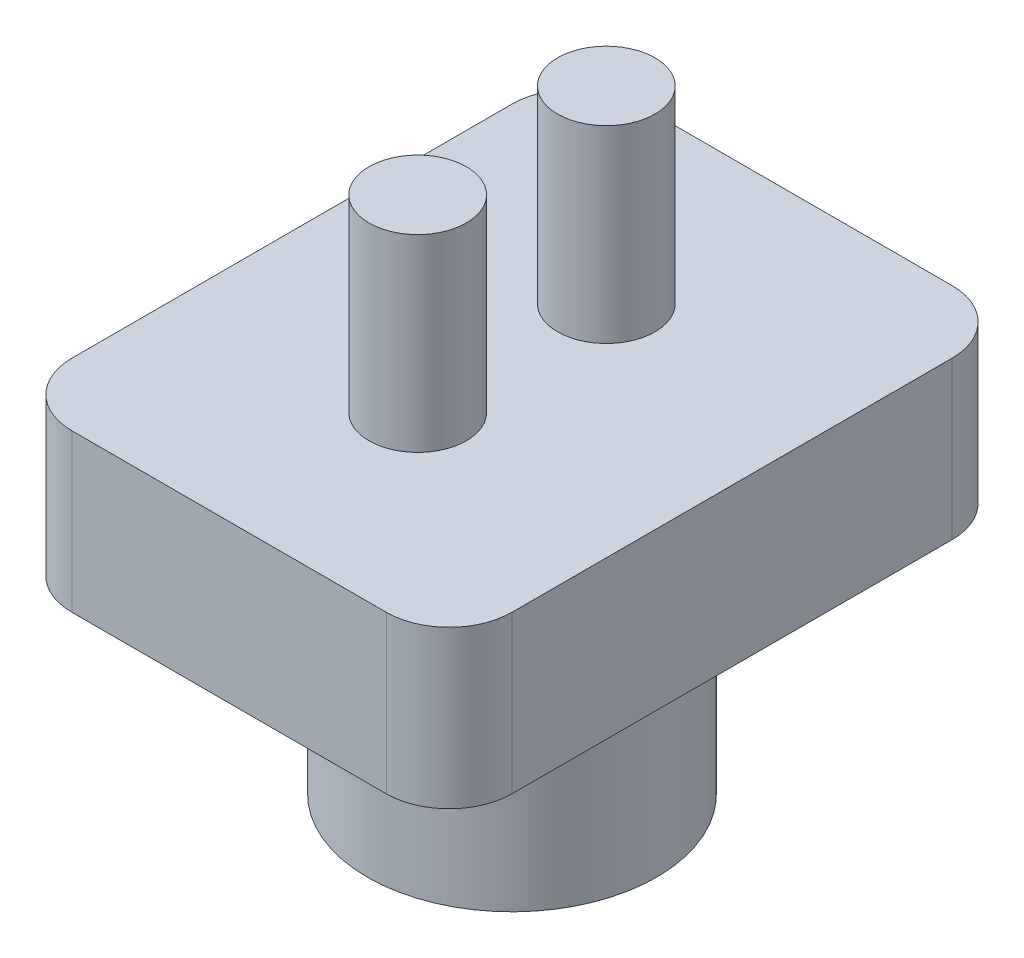
ISO-10303-21;
HEADER;
FILE_DESCRIPTION(('STEP AP214'),'2;1');
FILE_NAME('part.step','',(''),(''),'','','');
FILE_SCHEMA(('AUTOMOTIVE_DESIGN { 1 0 10303 214 1 1 1 1 }'));
ENDSEC;
DATA;
#1=APPLICATION_CONTEXT('core data for automotive mechanical design processes');
#2=APPLICATION_PROTOCOL_DEFINITION('international standard','automotive_design',2000,#1);
#3=PRODUCT_CONTEXT('',#1,'mechanical');
#4=PRODUCT('Part','Part','',(#3));
#5=PRODUCT_RELATED_PRODUCT_CATEGORY('part','',(#4));
#6=PRODUCT_DEFINITION_FORMATION('','',#4);
#7=PRODUCT_DEFINITION_CONTEXT('part definition',#1,'design');
#8=PRODUCT_DEFINITION('design','',#6,#7);
#9=PRODUCT_DEFINITION_SHAPE('','',#8);
#10=(LENGTH_UNIT() NAMED_UNIT(*) SI_UNIT(.MILLI.,.METRE.));
#11=(NAMED_UNIT(*) PLANE_ANGLE_UNIT() SI_UNIT($,.RADIAN.));
#12=(NAMED_UNIT(*) SI_UNIT($,.STERADIAN.) SOLID_ANGLE_UNIT());
#13=UNCERTAINTY_MEASURE_WITH_UNIT(LENGTH_MEASURE(1.E-05),#10,'distance_accuracy_value','');
#14=(GEOMETRIC_REPRESENTATION_CONTEXT(3) GLOBAL_UNCERTAINTY_ASSIGNED_CONTEXT((#13)) GLOBAL_UNIT_ASSIGNED_CONTEXT((#10,
#11,#12)) REPRESENTATION_CONTEXT('',''));
#15=CARTESIAN_POINT('',(0.,0.,0.));
#16=DIRECTION('',(0.,0.,1.));
#17=DIRECTION('',(1.,0.,0.));
#18=AXIS2_PLACEMENT_3D('',#15,#16,#17);
#19=CARTESIAN_POINT('',(0.,7.,0.));
#20=DIRECTION('',(0.,-1.,0.));
#21=DIRECTION('',(0.,0.,-1.));
#22=AXIS2_PLACEMENT_3D('',#19,#20,#21);
#23=CYLINDRICAL_SURFACE('',#22,2.8);
#24=CARTESIAN_POINT('',(0.,7.,0.));
#25=DIRECTION('',(0.,1.,0.));
#26=DIRECTION('',(0.,0.,1.));
#27=AXIS2_PLACEMENT_3D('',#24,#25,#26);
#28=CIRCLE('',#27,2.8);
#29=CARTESIAN_POINT('',(0.,7.,2.8));
#30=VERTEX_POINT('',#29);
#31=EDGE_CURVE('E143',#30,#30,#28,.T.);
#32=ORIENTED_EDGE('',*,*,#31,.T.);
#33=EDGE_LOOP('',(#32));
#34=FACE_BOUND('',#33,.T.);
#35=CARTESIAN_POINT('',(0.,0.,0.));
#36=DIRECTION('',(0.,1.,0.));
#37=DIRECTION('',(0.,0.,1.));
#38=AXIS2_PLACEMENT_3D('',#35,#36,#37);
#39=CIRCLE('',#38,2.8);
#40=CARTESIAN_POINT('',(0.,0.,2.8));
#41=VERTEX_POINT('',#40);
#42=EDGE_CURVE('E146',#41,#41,#39,.T.);
#43=ORIENTED_EDGE('',*,*,#42,.F.);
#44=EDGE_LOOP('',(#43));
#45=FACE_BOUND('',#44,.T.);
#46=ADVANCED_FACE('F34',(#34,#45),#23,.F.);
#47=CARTESIAN_POINT('',(0.,7.,0.));
#48=DIRECTION('',(0.,-1.,0.));
#49=DIRECTION('',(0.,0.,-1.));
#50=AXIS2_PLACEMENT_3D('',#47,#48,#49);
#51=CYLINDRICAL_SURFACE('',#50,4.6);
#52=CARTESIAN_POINT('',(0.,7.,0.));
#53=DIRECTION('',(0.,1.,0.));
#54=DIRECTION('',(0.,0.,1.));
#55=AXIS2_PLACEMENT_3D('',#52,#53,#54);
#56=CIRCLE('',#55,4.6);
#57=CARTESIAN_POINT('',(0.,7.,4.6));
#58=VERTEX_POINT('',#57);
#59=EDGE_CURVE('E147',#58,#58,#56,.T.);
#60=ORIENTED_EDGE('',*,*,#59,.F.);
#61=EDGE_LOOP('',(#60));
#62=FACE_BOUND('',#61,.T.);
#63=CARTESIAN_POINT('',(0.,0.,0.));
#64=DIRECTION('',(0.,1.,0.));
#65=DIRECTION('',(0.,0.,1.));
#66=AXIS2_PLACEMENT_3D('',#63,#64,#65);
#67=CIRCLE('',#66,4.6);
#68=CARTESIAN_POINT('',(0.,0.,4.6));
#69=VERTEX_POINT('',#68);
#70=EDGE_CURVE('E150',#69,#69,#67,.T.);
#71=ORIENTED_EDGE('',*,*,#70,.T.);
#72=EDGE_LOOP('',(#71));
#73=FACE_BOUND('',#72,.T.);
#74=ADVANCED_FACE('F229',(#62,#73),#51,.T.);
#75=CARTESIAN_POINT('',(0.,0.,0.));
#76=DIRECTION('',(0.,1.,0.));
#77=DIRECTION('',(0.,0.,1.));
#78=AXIS2_PLACEMENT_3D('',#75,#76,#77);
#79=PLANE('',#78);
#80=ORIENTED_EDGE('',*,*,#42,.T.);
#81=EDGE_LOOP('',(#80));
#82=FACE_BOUND('',#81,.T.);
#83=ORIENTED_EDGE('',*,*,#70,.F.);
#84=EDGE_LOOP('',(#83));
#85=FACE_BOUND('',#84,.T.);
#86=ADVANCED_FACE('F235',(#82,#85),#79,.F.);
#87=CARTESIAN_POINT('',(0.,7.,0.));
#88=DIRECTION('',(0.,1.,0.));
#89=DIRECTION('',(0.,0.,1.));
#90=AXIS2_PLACEMENT_3D('',#87,#88,#89);
#91=PLANE('',#90);
#92=ORIENTED_EDGE('',*,*,#59,.T.);
#93=EDGE_LOOP('',(#92));
#94=FACE_BOUND('',#93,.T.);
#95=DIRECTION('',(1.,0.,0.));
#96=VECTOR('',#95,1.);
#97=CARTESIAN_POINT('',(0.,7.,9.));
#98=LINE('',#97,#96);
#99=CARTESIAN_POINT('',(-5.,7.,9.));
#100=VERTEX_POINT('',#99);
#101=CARTESIAN_POINT('',(5.,7.,9.));
#102=VERTEX_POINT('',#101);
#103=EDGE_CURVE('E117',#100,#102,#98,.T.);
#104=ORIENTED_EDGE('',*,*,#103,.F.);
#105=CARTESIAN_POINT('',(-5.,7.,7.));
#106=DIRECTION('',(0.,1.,0.));
#107=DIRECTION('',(0.,0.,1.));
#108=AXIS2_PLACEMENT_3D('',#105,#106,#107);
#109=CIRCLE('',#108,2.);
#110=CARTESIAN_POINT('',(-7.,7.,7.));
#111=VERTEX_POINT('',#110);
#112=EDGE_CURVE('E100',#100,#111,#109,.F.);
#113=ORIENTED_EDGE('',*,*,#112,.T.);
#114=DIRECTION('',(0.,0.,-1.));
#115=VECTOR('',#114,1.);
#116=CARTESIAN_POINT('',(-7.,7.,0.));
#117=LINE('',#116,#115);
#118=CARTESIAN_POINT('',(-7.,7.,-7.));
#119=VERTEX_POINT('',#118);
#120=EDGE_CURVE('E141',#111,#119,#117,.T.);
#121=ORIENTED_EDGE('',*,*,#120,.T.);
#122=CARTESIAN_POINT('',(-5.,7.,-7.));
#123=DIRECTION('',(0.,1.,0.));
#124=DIRECTION('',(0.,0.,1.));
#125=AXIS2_PLACEMENT_3D('',#122,#123,#124);
#126=CIRCLE('',#125,2.);
#127=CARTESIAN_POINT('',(-5.,7.,-9.));
#128=VERTEX_POINT('',#127);
#129=EDGE_CURVE('E111',#119,#128,#126,.F.);
#130=ORIENTED_EDGE('',*,*,#129,.T.);
#131=DIRECTION('',(1.,0.,0.));
#132=VECTOR('',#131,1.);
#133=CARTESIAN_POINT('',(0.,7.,-9.));
#134=LINE('',#133,#132);
#135=CARTESIAN_POINT('',(5.,7.,-9.));
#136=VERTEX_POINT('',#135);
#137=EDGE_CURVE('E130',#128,#136,#134,.T.);
#138=ORIENTED_EDGE('',*,*,#137,.T.);
#139=CARTESIAN_POINT('',(5.,7.,-7.));
#140=DIRECTION('',(0.,1.,0.));
#141=DIRECTION('',(0.,0.,1.));
#142=AXIS2_PLACEMENT_3D('',#139,#140,#141);
#143=CIRCLE('',#142,2.);
#144=CARTESIAN_POINT('',(7.,7.,-7.));
#145=VERTEX_POINT('',#144);
#146=EDGE_CURVE('E157',#136,#145,#143,.F.);
#147=ORIENTED_EDGE('',*,*,#146,.T.);
#148=DIRECTION('',(0.,0.,-1.));
#149=VECTOR('',#148,1.);
#150=CARTESIAN_POINT('',(7.,7.,0.));
#151=LINE('',#150,#149);
#152=CARTESIAN_POINT('',(7.,7.,7.));
#153=VERTEX_POINT('',#152);
#154=EDGE_CURVE('E126',#153,#145,#151,.T.);
#155=ORIENTED_EDGE('',*,*,#154,.F.);
#156=CARTESIAN_POINT('',(5.,7.,7.));
#157=DIRECTION('',(0.,1.,0.));
#158=DIRECTION('',(0.,0.,1.));
#159=AXIS2_PLACEMENT_3D('',#156,#157,#158);
#160=CIRCLE('',#159,2.);
#161=EDGE_CURVE('E121',#153,#102,#160,.F.);
#162=ORIENTED_EDGE('',*,*,#161,.T.);
#163=EDGE_LOOP('',(#104,#113,#121,#130,#138,#147,#155,#162));
#164=FACE_BOUND('',#163,.T.);
#165=ADVANCED_FACE('F124',(#94,#164),#91,.F.);
#166=CARTESIAN_POINT('',(0.,12.,0.));
#167=DIRECTION('',(0.,1.,0.));
#168=DIRECTION('',(0.,0.,1.));
#169=AXIS2_PLACEMENT_3D('',#166,#167,#168);
#170=PLANE('',#169);
#171=CARTESIAN_POINT('',(0.,12.,3.));
#172=DIRECTION('',(0.,1.,0.));
#173=DIRECTION('',(0.,0.,1.));
#174=AXIS2_PLACEMENT_3D('',#171,#172,#173);
#175=CIRCLE('',#174,1.55);
#176=CARTESIAN_POINT('',(0.,12.,4.55));
#177=VERTEX_POINT('',#176);
#178=EDGE_CURVE('E195',#177,#177,#175,.T.);
#179=ORIENTED_EDGE('',*,*,#178,.F.);
#180=EDGE_LOOP('',(#179));
#181=FACE_BOUND('',#180,.T.);
#182=CARTESIAN_POINT('',(0.,12.,-3.));
#183=DIRECTION('',(0.,1.,0.));
#184=DIRECTION('',(0.,0.,1.));
#185=AXIS2_PLACEMENT_3D('',#182,#183,#184);
#186=CIRCLE('',#185,1.55);
#187=CARTESIAN_POINT('',(0.,12.,-1.45));
#188=VERTEX_POINT('',#187);
#189=EDGE_CURVE('E133',#188,#188,#186,.T.);
#190=ORIENTED_EDGE('',*,*,#189,.F.);
#191=EDGE_LOOP('',(#190));
#192=FACE_BOUND('',#191,.T.);
#193=DIRECTION('',(0.,0.,-1.));
#194=VECTOR('',#193,1.);
#195=CARTESIAN_POINT('',(-7.,12.,0.));
#196=LINE('',#195,#194);
#197=CARTESIAN_POINT('',(-7.,12.,7.));
#198=VERTEX_POINT('',#197);
#199=CARTESIAN_POINT('',(-7.,12.,-7.));
#200=VERTEX_POINT('',#199);
#201=EDGE_CURVE('E136',#198,#200,#196,.T.);
#202=ORIENTED_EDGE('',*,*,#201,.F.);
#203=CARTESIAN_POINT('',(-5.,12.,7.));
#204=DIRECTION('',(0.,1.,0.));
#205=DIRECTION('',(0.,0.,1.));
#206=AXIS2_PLACEMENT_3D('',#203,#204,#205);
#207=CIRCLE('',#206,2.);
#208=CARTESIAN_POINT('',(-5.,12.,9.));
#209=VERTEX_POINT('',#208);
#210=EDGE_CURVE('E168',#198,#209,#207,.T.);
#211=ORIENTED_EDGE('',*,*,#210,.T.);
#212=DIRECTION('',(1.,0.,0.));
#213=VECTOR('',#212,1.);
#214=CARTESIAN_POINT('',(0.,12.,9.));
#215=LINE('',#214,#213);
#216=CARTESIAN_POINT('',(5.,12.,9.));
#217=VERTEX_POINT('',#216);
#218=EDGE_CURVE('E120',#209,#217,#215,.T.);
#219=ORIENTED_EDGE('',*,*,#218,.T.);
#220=CARTESIAN_POINT('',(5.,12.,7.));
#221=DIRECTION('',(0.,1.,0.));
#222=DIRECTION('',(0.,0.,1.));
#223=AXIS2_PLACEMENT_3D('',#220,#221,#222);
#224=CIRCLE('',#223,2.);
#225=CARTESIAN_POINT('',(7.,12.,7.));
#226=VERTEX_POINT('',#225);
#227=EDGE_CURVE('E163',#217,#226,#224,.T.);
#228=ORIENTED_EDGE('',*,*,#227,.T.);
#229=DIRECTION('',(0.,0.,-1.));
#230=VECTOR('',#229,1.);
#231=CARTESIAN_POINT('',(7.,12.,0.));
#232=LINE('',#231,#230);
#233=CARTESIAN_POINT('',(7.,12.,-7.));
#234=VERTEX_POINT('',#233);
#235=EDGE_CURVE('E179',#226,#234,#232,.T.);
#236=ORIENTED_EDGE('',*,*,#235,.T.);
#237=CARTESIAN_POINT('',(5.,12.,-7.));
#238=DIRECTION('',(0.,1.,0.));
#239=DIRECTION('',(0.,0.,1.));
#240=AXIS2_PLACEMENT_3D('',#237,#238,#239);
#241=CIRCLE('',#240,2.);
#242=CARTESIAN_POINT('',(5.,12.,-9.));
#243=VERTEX_POINT('',#242);
#244=EDGE_CURVE('E49',#234,#243,#241,.T.);
#245=ORIENTED_EDGE('',*,*,#244,.T.);
#246=DIRECTION('',(1.,0.,0.));
#247=VECTOR('',#246,1.);
#248=CARTESIAN_POINT('',(0.,12.,-9.));
#249=LINE('',#248,#247);
#250=CARTESIAN_POINT('',(-5.,12.,-9.));
#251=VERTEX_POINT('',#250);
#252=EDGE_CURVE('E186',#251,#243,#249,.T.);
#253=ORIENTED_EDGE('',*,*,#252,.F.);
#254=CARTESIAN_POINT('',(-5.,12.,-7.));
#255=DIRECTION('',(0.,1.,0.));
#256=DIRECTION('',(0.,0.,1.));
#257=AXIS2_PLACEMENT_3D('',#254,#255,#256);
#258=CIRCLE('',#257,2.);
#259=EDGE_CURVE('E166',#251,#200,#258,.T.);
#260=ORIENTED_EDGE('',*,*,#259,.T.);
#261=EDGE_LOOP('',(#202,#211,#219,#228,#236,#245,#253,#260));
#262=FACE_BOUND('',#261,.T.);
#263=ADVANCED_FACE('F210',(#181,#192,#262),#170,.T.);
#264=CARTESIAN_POINT('',(-7.,12.,0.));
#265=DIRECTION('',(-1.,0.,0.));
#266=DIRECTION('',(0.,0.,1.));
#267=AXIS2_PLACEMENT_3D('',#264,#265,#266);
#268=PLANE('',#267);
#269=ORIENTED_EDGE('',*,*,#120,.F.);
#270=DIRECTION('',(0.,-1.,0.));
#271=VECTOR('',#270,1.);
#272=CARTESIAN_POINT('',(-7.,12.,7.));
#273=LINE('',#272,#271);
#274=EDGE_CURVE('E105',#111,#198,#273,.F.);
#275=ORIENTED_EDGE('',*,*,#274,.T.);
#276=ORIENTED_EDGE('',*,*,#201,.T.);
#277=DIRECTION('',(0.,-1.,0.));
#278=VECTOR('',#277,1.);
#279=CARTESIAN_POINT('',(-7.,12.,-7.));
#280=LINE('',#279,#278);
#281=EDGE_CURVE('E110',#200,#119,#280,.T.);
#282=ORIENTED_EDGE('',*,*,#281,.T.);
#283=EDGE_LOOP('',(#269,#275,#276,#282));
#284=FACE_BOUND('',#283,.T.);
#285=ADVANCED_FACE('F213',(#284),#268,.T.);
#286=CARTESIAN_POINT('',(0.,12.,-9.));
#287=DIRECTION('',(0.,0.,-1.));
#288=DIRECTION('',(-1.,0.,0.));
#289=AXIS2_PLACEMENT_3D('',#286,#287,#288);
#290=PLANE('',#289);
#291=ORIENTED_EDGE('',*,*,#137,.F.);
#292=DIRECTION('',(0.,-1.,0.));
#293=VECTOR('',#292,1.);
#294=CARTESIAN_POINT('',(-5.,12.,-9.));
#295=LINE('',#294,#293);
#296=EDGE_CURVE('E56',#128,#251,#295,.F.);
#297=ORIENTED_EDGE('',*,*,#296,.T.);
#298=ORIENTED_EDGE('',*,*,#252,.T.);
#299=DIRECTION('',(0.,-1.,0.));
#300=VECTOR('',#299,1.);
#301=CARTESIAN_POINT('',(5.,7.,-9.));
#302=LINE('',#301,#300);
#303=EDGE_CURVE('E170',#243,#136,#302,.T.);
#304=ORIENTED_EDGE('',*,*,#303,.T.);
#305=EDGE_LOOP('',(#291,#297,#298,#304));
#306=FACE_BOUND('',#305,.T.);
#307=ADVANCED_FACE('F185',(#306),#290,.T.);
#308=CARTESIAN_POINT('',(7.,12.,0.));
#309=DIRECTION('',(-1.,0.,0.));
#310=DIRECTION('',(0.,0.,1.));
#311=AXIS2_PLACEMENT_3D('',#308,#309,#310);
#312=PLANE('',#311);
#313=ORIENTED_EDGE('',*,*,#154,.T.);
#314=DIRECTION('',(0.,-1.,0.));
#315=VECTOR('',#314,1.);
#316=CARTESIAN_POINT('',(7.,12.,-7.));
#317=LINE('',#316,#315);
#318=EDGE_CURVE('E11',#145,#234,#317,.F.);
#319=ORIENTED_EDGE('',*,*,#318,.T.);
#320=ORIENTED_EDGE('',*,*,#235,.F.);
#321=DIRECTION('',(0.,-1.,0.));
#322=VECTOR('',#321,1.);
#323=CARTESIAN_POINT('',(7.,12.,7.));
#324=LINE('',#323,#322);
#325=EDGE_CURVE('E42',#226,#153,#324,.T.);
#326=ORIENTED_EDGE('',*,*,#325,.T.);
#327=EDGE_LOOP('',(#313,#319,#320,#326));
#328=FACE_BOUND('',#327,.T.);
#329=ADVANCED_FACE('F177',(#328),#312,.F.);
#330=CARTESIAN_POINT('',(0.,12.,9.));
#331=DIRECTION('',(0.,0.,-1.));
#332=DIRECTION('',(-1.,0.,0.));
#333=AXIS2_PLACEMENT_3D('',#330,#331,#332);
#334=PLANE('',#333);
#335=ORIENTED_EDGE('',*,*,#218,.F.);
#336=DIRECTION('',(0.,-1.,0.));
#337=VECTOR('',#336,1.);
#338=CARTESIAN_POINT('',(-5.,7.,9.));
#339=LINE('',#338,#337);
#340=EDGE_CURVE('E104',#209,#100,#339,.T.);
#341=ORIENTED_EDGE('',*,*,#340,.T.);
#342=ORIENTED_EDGE('',*,*,#103,.T.);
#343=DIRECTION('',(0.,-1.,0.));
#344=VECTOR('',#343,1.);
#345=CARTESIAN_POINT('',(5.,12.,9.));
#346=LINE('',#345,#344);
#347=EDGE_CURVE('E122',#102,#217,#346,.F.);
#348=ORIENTED_EDGE('',*,*,#347,.T.);
#349=EDGE_LOOP('',(#335,#341,#342,#348));
#350=FACE_BOUND('',#349,.T.);
#351=ADVANCED_FACE('F116',(#350),#334,.F.);
#352=ORIENTED_EDGE('',*,*,#31,.F.);
#353=EDGE_LOOP('',(#352));
#354=FACE_BOUND('',#353,.T.);
#355=ADVANCED_FACE('F245',(#354),#91,.F.);
#356=CARTESIAN_POINT('',(0.,18.,-3.));
#357=DIRECTION('',(0.,-1.,0.));
#358=DIRECTION('',(0.,0.,-1.));
#359=AXIS2_PLACEMENT_3D('',#356,#357,#358);
#360=CYLINDRICAL_SURFACE('',#359,1.55);
#361=CARTESIAN_POINT('',(0.,18.,-3.));
#362=DIRECTION('',(0.,1.,0.));
#363=DIRECTION('',(0.,0.,1.));
#364=AXIS2_PLACEMENT_3D('',#361,#362,#363);
#365=CIRCLE('',#364,1.55);
#366=CARTESIAN_POINT('',(0.,18.,-1.45));
#367=VERTEX_POINT('',#366);
#368=EDGE_CURVE('E127',#367,#367,#365,.T.);
#369=ORIENTED_EDGE('',*,*,#368,.F.);
#370=EDGE_LOOP('',(#369));
#371=FACE_BOUND('',#370,.T.);
#372=ORIENTED_EDGE('',*,*,#189,.T.);
#373=EDGE_LOOP('',(#372));
#374=FACE_BOUND('',#373,.T.);
#375=ADVANCED_FACE('F255',(#371,#374),#360,.T.);
#376=CARTESIAN_POINT('',(0.,18.,-3.));
#377=DIRECTION('',(0.,1.,0.));
#378=DIRECTION('',(0.,0.,1.));
#379=AXIS2_PLACEMENT_3D('',#376,#377,#378);
#380=PLANE('',#379);
#381=ORIENTED_EDGE('',*,*,#368,.T.);
#382=EDGE_LOOP('',(#381));
#383=FACE_BOUND('',#382,.T.);
#384=ADVANCED_FACE('F206',(#383),#380,.T.);
#385=CARTESIAN_POINT('',(0.,18.,3.));
#386=DIRECTION('',(0.,-1.,0.));
#387=DIRECTION('',(0.,0.,-1.));
#388=AXIS2_PLACEMENT_3D('',#385,#386,#387);
#389=CYLINDRICAL_SURFACE('',#388,1.55);
#390=CARTESIAN_POINT('',(0.,18.,3.));
#391=DIRECTION('',(0.,1.,0.));
#392=DIRECTION('',(0.,0.,1.));
#393=AXIS2_PLACEMENT_3D('',#390,#391,#392);
#394=CIRCLE('',#393,1.55);
#395=CARTESIAN_POINT('',(0.,18.,4.55));
#396=VERTEX_POINT('',#395);
#397=EDGE_CURVE('E193',#396,#396,#394,.T.);
#398=ORIENTED_EDGE('',*,*,#397,.F.);
#399=EDGE_LOOP('',(#398));
#400=FACE_BOUND('',#399,.T.);
#401=ORIENTED_EDGE('',*,*,#178,.T.);
#402=EDGE_LOOP('',(#401));
#403=FACE_BOUND('',#402,.T.);
#404=ADVANCED_FACE('F203',(#400,#403),#389,.T.);
#405=CARTESIAN_POINT('',(0.,18.,3.));
#406=DIRECTION('',(0.,1.,0.));
#407=DIRECTION('',(0.,0.,1.));
#408=AXIS2_PLACEMENT_3D('',#405,#406,#407);
#409=PLANE('',#408);
#410=ORIENTED_EDGE('',*,*,#397,.T.);
#411=EDGE_LOOP('',(#410));
#412=FACE_BOUND('',#411,.T.);
#413=ADVANCED_FACE('F201',(#412),#409,.T.);
#414=CARTESIAN_POINT('',(-5.,12.,7.));
#415=DIRECTION('',(0.,1.,0.));
#416=DIRECTION('',(0.,0.,1.));
#417=AXIS2_PLACEMENT_3D('',#414,#415,#416);
#418=CYLINDRICAL_SURFACE('',#417,2.);
#419=ORIENTED_EDGE('',*,*,#210,.F.);
#420=ORIENTED_EDGE('',*,*,#274,.F.);
#421=ORIENTED_EDGE('',*,*,#112,.F.);
#422=ORIENTED_EDGE('',*,*,#340,.F.);
#423=EDGE_LOOP('',(#419,#420,#421,#422));
#424=FACE_BOUND('',#423,.T.);
#425=ADVANCED_FACE('F103',(#424),#418,.T.);
#426=CARTESIAN_POINT('',(-5.,12.,-7.));
#427=DIRECTION('',(0.,-1.,0.));
#428=DIRECTION('',(0.,0.,-1.));
#429=AXIS2_PLACEMENT_3D('',#426,#427,#428);
#430=CYLINDRICAL_SURFACE('',#429,2.);
#431=ORIENTED_EDGE('',*,*,#259,.F.);
#432=ORIENTED_EDGE('',*,*,#296,.F.);
#433=ORIENTED_EDGE('',*,*,#129,.F.);
#434=ORIENTED_EDGE('',*,*,#281,.F.);
#435=EDGE_LOOP('',(#431,#432,#433,#434));
#436=FACE_BOUND('',#435,.T.);
#437=ADVANCED_FACE('F220',(#436),#430,.T.);
#438=CARTESIAN_POINT('',(5.,12.,-7.));
#439=DIRECTION('',(0.,1.,0.));
#440=DIRECTION('',(0.,0.,1.));
#441=AXIS2_PLACEMENT_3D('',#438,#439,#440);
#442=CYLINDRICAL_SURFACE('',#441,2.);
#443=ORIENTED_EDGE('',*,*,#244,.F.);
#444=ORIENTED_EDGE('',*,*,#318,.F.);
#445=ORIENTED_EDGE('',*,*,#146,.F.);
#446=ORIENTED_EDGE('',*,*,#303,.F.);
#447=EDGE_LOOP('',(#443,#444,#445,#446));
#448=FACE_BOUND('',#447,.T.);
#449=ADVANCED_FACE('F184',(#448),#442,.T.);
#450=CARTESIAN_POINT('',(5.,12.,7.));
#451=DIRECTION('',(0.,-1.,0.));
#452=DIRECTION('',(0.,0.,-1.));
#453=AXIS2_PLACEMENT_3D('',#450,#451,#452);
#454=CYLINDRICAL_SURFACE('',#453,2.);
#455=ORIENTED_EDGE('',*,*,#227,.F.);
#456=ORIENTED_EDGE('',*,*,#347,.F.);
#457=ORIENTED_EDGE('',*,*,#161,.F.);
#458=ORIENTED_EDGE('',*,*,#325,.F.);
#459=EDGE_LOOP('',(#455,#456,#457,#458));
#460=FACE_BOUND('',#459,.T.);
#461=ADVANCED_FACE('F36',(#460),#454,.T.);
#462=CLOSED_SHELL('',(#46,#74,#86,#165,#263,#285,#307,#329,#351,#355,#375,#384,#404,#413,#425,
#437,#449,#461));
#463=MANIFOLD_SOLID_BREP('B2',#462);
#464=ADVANCED_BREP_SHAPE_REPRESENTATION('',(#18,#463),#14);
#465=SHAPE_DEFINITION_REPRESENTATION(#9,#464);
ENDSEC;
END-ISO-10303-21;
